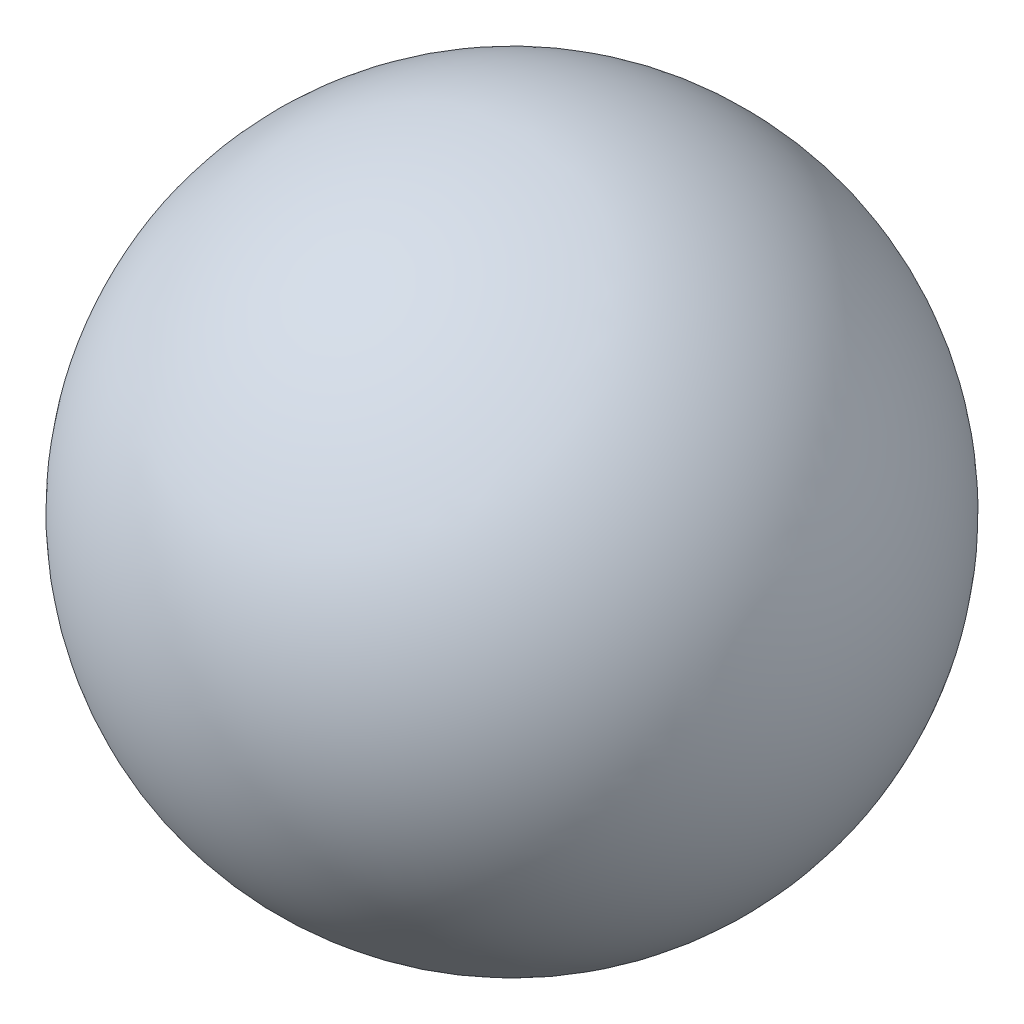
ISO-10303-21;
HEADER;
FILE_DESCRIPTION(('STEP AP214'),'2;1');
FILE_NAME('part.step','',(''),(''),'','','');
FILE_SCHEMA(('AUTOMOTIVE_DESIGN { 1 0 10303 214 1 1 1 1 }'));
ENDSEC;
DATA;
#1=APPLICATION_CONTEXT('core data for automotive mechanical design processes');
#2=APPLICATION_PROTOCOL_DEFINITION('international standard','automotive_design',2000,#1);
#3=PRODUCT_CONTEXT('',#1,'mechanical');
#4=PRODUCT('Part','Part','',(#3));
#5=PRODUCT_RELATED_PRODUCT_CATEGORY('part','',(#4));
#6=PRODUCT_DEFINITION_FORMATION('','',#4);
#7=PRODUCT_DEFINITION_CONTEXT('part definition',#1,'design');
#8=PRODUCT_DEFINITION('design','',#6,#7);
#9=PRODUCT_DEFINITION_SHAPE('','',#8);
#10=(LENGTH_UNIT() NAMED_UNIT(*) SI_UNIT(.MILLI.,.METRE.));
#11=(NAMED_UNIT(*) PLANE_ANGLE_UNIT() SI_UNIT($,.RADIAN.));
#12=(NAMED_UNIT(*) SI_UNIT($,.STERADIAN.) SOLID_ANGLE_UNIT());
#13=UNCERTAINTY_MEASURE_WITH_UNIT(LENGTH_MEASURE(1.E-05),#10,'distance_accuracy_value','');
#14=(GEOMETRIC_REPRESENTATION_CONTEXT(3) GLOBAL_UNCERTAINTY_ASSIGNED_CONTEXT((#13)) GLOBAL_UNIT_ASSIGNED_CONTEXT((#10,
#11,#12)) REPRESENTATION_CONTEXT('',''));
#15=CARTESIAN_POINT('',(0.,0.,0.));
#16=DIRECTION('',(0.,0.,1.));
#17=DIRECTION('',(1.,0.,0.));
#18=AXIS2_PLACEMENT_3D('',#15,#16,#17);
#19=CARTESIAN_POINT('',(0.0464613750613355,0.138507720151892,0.));
#20=DIRECTION('',(-0.999940966268048,-0.0108657249607522,0.));
#21=DIRECTION('',(-0.0108657249607522,0.999940966268048,0.));
#22=AXIS2_PLACEMENT_3D('',#19,#20,#21);
#23=SPHERICAL_SURFACE('',#22,12.7);
#24=CARTESIAN_POINT('',(-12.6527888965429,0.000513013150339568,0.));
#25=VERTEX_POINT('',#24);
#26=VERTEX_LOOP('',#25);
#27=FACE_BOUND('',#26,.T.);
#28=ADVANCED_FACE('F30',(#27),#23,.T.);
#29=CLOSED_SHELL('',(#28));
#30=MANIFOLD_SOLID_BREP('B2',#29);
#31=ADVANCED_BREP_SHAPE_REPRESENTATION('',(#18,#30),#14);
#32=SHAPE_DEFINITION_REPRESENTATION(#9,#31);
ENDSEC;
END-ISO-10303-21;
